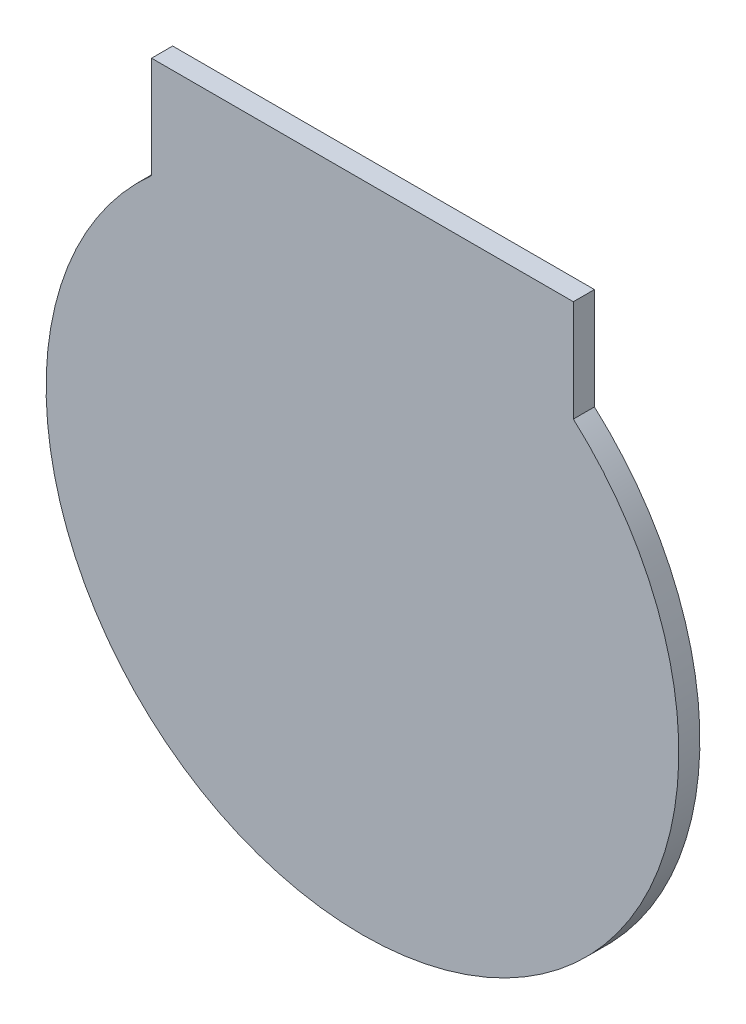
ISO-10303-21;
HEADER;
FILE_DESCRIPTION(('STEP AP214'),'2;1');
FILE_NAME('part.step','',(''),(''),'','','');
FILE_SCHEMA(('AUTOMOTIVE_DESIGN { 1 0 10303 214 1 1 1 1 }'));
ENDSEC;
DATA;
#1=APPLICATION_CONTEXT('core data for automotive mechanical design processes');
#2=APPLICATION_PROTOCOL_DEFINITION('international standard','automotive_design',2000,#1);
#3=PRODUCT_CONTEXT('',#1,'mechanical');
#4=PRODUCT('Part','Part','',(#3));
#5=PRODUCT_RELATED_PRODUCT_CATEGORY('part','',(#4));
#6=PRODUCT_DEFINITION_FORMATION('','',#4);
#7=PRODUCT_DEFINITION_CONTEXT('part definition',#1,'design');
#8=PRODUCT_DEFINITION('design','',#6,#7);
#9=PRODUCT_DEFINITION_SHAPE('','',#8);
#10=(LENGTH_UNIT() NAMED_UNIT(*) SI_UNIT(.MILLI.,.METRE.));
#11=(NAMED_UNIT(*) PLANE_ANGLE_UNIT() SI_UNIT($,.RADIAN.));
#12=(NAMED_UNIT(*) SI_UNIT($,.STERADIAN.) SOLID_ANGLE_UNIT());
#13=UNCERTAINTY_MEASURE_WITH_UNIT(LENGTH_MEASURE(1.E-05),#10,'distance_accuracy_value','');
#14=(GEOMETRIC_REPRESENTATION_CONTEXT(3) GLOBAL_UNCERTAINTY_ASSIGNED_CONTEXT((#13)) GLOBAL_UNIT_ASSIGNED_CONTEXT((#10,
#11,#12)) REPRESENTATION_CONTEXT('',''));
#15=CARTESIAN_POINT('',(0.,0.,0.));
#16=DIRECTION('',(0.,0.,1.));
#17=DIRECTION('',(1.,0.,0.));
#18=AXIS2_PLACEMENT_3D('',#15,#16,#17);
#19=CARTESIAN_POINT('',(44.4954054611148,-168.430491325062,5.));
#20=DIRECTION('',(-1.,0.,0.));
#21=DIRECTION('',(0.,0.,1.));
#22=AXIS2_PLACEMENT_3D('',#19,#20,#21);
#23=PLANE('',#22);
#24=DIRECTION('',(0.,1.,0.));
#25=VECTOR('',#24,1.);
#26=CARTESIAN_POINT('',(44.4954054611148,-168.430491325062,0.));
#27=LINE('',#26,#25);
#28=CARTESIAN_POINT('',(44.4954054611148,-168.430491325062,0.));
#29=VERTEX_POINT('',#28);
#30=CARTESIAN_POINT('',(44.4954054611148,-144.332190762557,0.));
#31=VERTEX_POINT('',#30);
#32=EDGE_CURVE('E97',#29,#31,#27,.T.);
#33=ORIENTED_EDGE('',*,*,#32,.T.);
#34=DIRECTION('',(0.,0.,-1.));
#35=VECTOR('',#34,1.);
#36=CARTESIAN_POINT('',(44.4954054611148,-144.332190762557,5.));
#37=LINE('',#36,#35);
#38=CARTESIAN_POINT('',(44.4954054611148,-144.332190762557,5.));
#39=VERTEX_POINT('',#38);
#40=EDGE_CURVE('E11',#39,#31,#37,.T.);
#41=ORIENTED_EDGE('',*,*,#40,.F.);
#42=DIRECTION('',(0.,1.,0.));
#43=VECTOR('',#42,1.);
#44=CARTESIAN_POINT('',(44.4954054611148,-168.430491325062,5.));
#45=LINE('',#44,#43);
#46=CARTESIAN_POINT('',(44.4954054611148,-168.430491325062,5.));
#47=VERTEX_POINT('',#46);
#48=EDGE_CURVE('E85',#47,#39,#45,.T.);
#49=ORIENTED_EDGE('',*,*,#48,.F.);
#50=DIRECTION('',(0.,0.,-1.));
#51=VECTOR('',#50,1.);
#52=CARTESIAN_POINT('',(44.4954054611148,-168.430491325062,5.));
#53=LINE('',#52,#51);
#54=EDGE_CURVE('E93',#47,#29,#53,.T.);
#55=ORIENTED_EDGE('',*,*,#54,.T.);
#56=EDGE_LOOP('',(#33,#41,#49,#55));
#57=FACE_BOUND('',#56,.T.);
#58=ADVANCED_FACE('F34',(#57),#23,.F.);
#59=CARTESIAN_POINT('',(-55.5045945388852,-144.332190762557,5.));
#60=DIRECTION('',(0.,-1.,0.));
#61=DIRECTION('',(0.,0.,-1.));
#62=AXIS2_PLACEMENT_3D('',#59,#60,#61);
#63=PLANE('',#62);
#64=DIRECTION('',(-1.,0.,0.));
#65=VECTOR('',#64,1.);
#66=CARTESIAN_POINT('',(-55.5045945388852,-144.332190762557,0.));
#67=LINE('',#66,#65);
#68=CARTESIAN_POINT('',(-55.5045945388852,-144.332190762557,0.));
#69=VERTEX_POINT('',#68);
#70=EDGE_CURVE('E89',#31,#69,#67,.T.);
#71=ORIENTED_EDGE('',*,*,#70,.T.);
#72=DIRECTION('',(0.,0.,-1.));
#73=VECTOR('',#72,1.);
#74=CARTESIAN_POINT('',(-55.5045945388852,-144.332190762557,5.));
#75=LINE('',#74,#73);
#76=CARTESIAN_POINT('',(-55.5045945388852,-144.332190762557,5.));
#77=VERTEX_POINT('',#76);
#78=EDGE_CURVE('E42',#77,#69,#75,.T.);
#79=ORIENTED_EDGE('',*,*,#78,.F.);
#80=DIRECTION('',(-1.,0.,0.));
#81=VECTOR('',#80,1.);
#82=CARTESIAN_POINT('',(-55.5045945388852,-144.332190762557,5.));
#83=LINE('',#82,#81);
#84=EDGE_CURVE('E80',#39,#77,#83,.T.);
#85=ORIENTED_EDGE('',*,*,#84,.F.);
#86=ORIENTED_EDGE('',*,*,#40,.T.);
#87=EDGE_LOOP('',(#71,#79,#85,#86));
#88=FACE_BOUND('',#87,.T.);
#89=ADVANCED_FACE('F88',(#88),#63,.F.);
#90=CARTESIAN_POINT('',(-55.5045945388852,-168.430491325062,5.));
#91=DIRECTION('',(1.,0.,0.));
#92=DIRECTION('',(0.,1.,0.));
#93=AXIS2_PLACEMENT_3D('',#90,#91,#92);
#94=PLANE('',#93);
#95=DIRECTION('',(0.,-1.,0.));
#96=VECTOR('',#95,1.);
#97=CARTESIAN_POINT('',(-55.5045945388852,-168.430491325062,0.));
#98=LINE('',#97,#96);
#99=CARTESIAN_POINT('',(-55.5045945388852,-168.430491325062,0.));
#100=VERTEX_POINT('',#99);
#101=EDGE_CURVE('E67',#69,#100,#98,.T.);
#102=ORIENTED_EDGE('',*,*,#101,.T.);
#103=DIRECTION('',(0.,0.,-1.));
#104=VECTOR('',#103,1.);
#105=CARTESIAN_POINT('',(-55.5045945388852,-168.430491325062,5.));
#106=LINE('',#105,#104);
#107=CARTESIAN_POINT('',(-55.5045945388852,-168.430491325062,5.));
#108=VERTEX_POINT('',#107);
#109=EDGE_CURVE('E90',#108,#100,#106,.T.);
#110=ORIENTED_EDGE('',*,*,#109,.F.);
#111=DIRECTION('',(0.,-1.,0.));
#112=VECTOR('',#111,1.);
#113=CARTESIAN_POINT('',(-55.5045945388852,-168.430491325062,5.));
#114=LINE('',#113,#112);
#115=EDGE_CURVE('E83',#77,#108,#114,.T.);
#116=ORIENTED_EDGE('',*,*,#115,.F.);
#117=ORIENTED_EDGE('',*,*,#78,.T.);
#118=EDGE_LOOP('',(#102,#110,#116,#117));
#119=FACE_BOUND('',#118,.T.);
#120=ADVANCED_FACE('F91',(#119),#94,.F.);
#121=CARTESIAN_POINT('',(-5.50459453888519,-224.332190762557,5.));
#122=DIRECTION('',(0.,0.,-1.));
#123=DIRECTION('',(-1.,0.,0.));
#124=AXIS2_PLACEMENT_3D('',#121,#122,#123);
#125=CYLINDRICAL_SURFACE('',#124,75.);
#126=CARTESIAN_POINT('',(-5.50459453888519,-224.332190762557,0.));
#127=DIRECTION('',(0.,0.,1.));
#128=DIRECTION('',(1.,0.,0.));
#129=AXIS2_PLACEMENT_3D('',#126,#127,#128);
#130=CIRCLE('',#129,75.);
#131=EDGE_CURVE('E73',#100,#29,#130,.T.);
#132=ORIENTED_EDGE('',*,*,#131,.T.);
#133=ORIENTED_EDGE('',*,*,#54,.F.);
#134=CARTESIAN_POINT('',(-5.50459453888519,-224.332190762557,5.));
#135=DIRECTION('',(0.,0.,1.));
#136=DIRECTION('',(1.,0.,0.));
#137=AXIS2_PLACEMENT_3D('',#134,#135,#136);
#138=CIRCLE('',#137,75.);
#139=EDGE_CURVE('E50',#108,#47,#138,.T.);
#140=ORIENTED_EDGE('',*,*,#139,.F.);
#141=ORIENTED_EDGE('',*,*,#109,.T.);
#142=EDGE_LOOP('',(#132,#133,#140,#141));
#143=FACE_BOUND('',#142,.T.);
#144=ADVANCED_FACE('F104',(#143),#125,.T.);
#145=CARTESIAN_POINT('',(-5.50459453888519,-224.332190762557,5.));
#146=DIRECTION('',(0.,0.,1.));
#147=DIRECTION('',(1.,0.,0.));
#148=AXIS2_PLACEMENT_3D('',#145,#146,#147);
#149=PLANE('',#148);
#150=ORIENTED_EDGE('',*,*,#48,.T.);
#151=ORIENTED_EDGE('',*,*,#84,.T.);
#152=ORIENTED_EDGE('',*,*,#115,.T.);
#153=ORIENTED_EDGE('',*,*,#139,.T.);
#154=EDGE_LOOP('',(#150,#151,#152,#153));
#155=FACE_BOUND('',#154,.T.);
#156=ADVANCED_FACE('F81',(#155),#149,.T.);
#157=CARTESIAN_POINT('',(-5.50459453888519,-224.332190762557,0.));
#158=DIRECTION('',(0.,0.,1.));
#159=DIRECTION('',(1.,0.,0.));
#160=AXIS2_PLACEMENT_3D('',#157,#158,#159);
#161=PLANE('',#160);
#162=ORIENTED_EDGE('',*,*,#32,.F.);
#163=ORIENTED_EDGE('',*,*,#131,.F.);
#164=ORIENTED_EDGE('',*,*,#101,.F.);
#165=ORIENTED_EDGE('',*,*,#70,.F.);
#166=EDGE_LOOP('',(#162,#163,#164,#165));
#167=FACE_BOUND('',#166,.T.);
#168=ADVANCED_FACE('F107',(#167),#161,.F.);
#169=CLOSED_SHELL('',(#58,#89,#120,#144,#156,#168));
#170=MANIFOLD_SOLID_BREP('B2',#169);
#171=ADVANCED_BREP_SHAPE_REPRESENTATION('',(#18,#170),#14);
#172=SHAPE_DEFINITION_REPRESENTATION(#9,#171);
ENDSEC;
END-ISO-10303-21;
